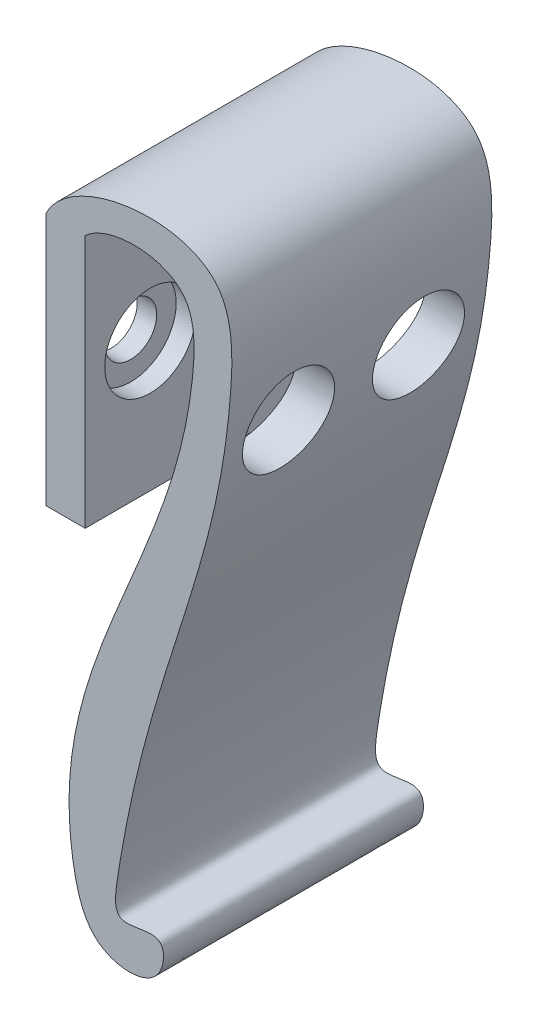
ISO-10303-21;
HEADER;
FILE_DESCRIPTION(('STEP AP214'),'2;1');
FILE_NAME('part.step','',(''),(''),'','','');
FILE_SCHEMA(('AUTOMOTIVE_DESIGN { 1 0 10303 214 1 1 1 1 }'));
ENDSEC;
DATA;
#1=APPLICATION_CONTEXT('core data for automotive mechanical design processes');
#2=APPLICATION_PROTOCOL_DEFINITION('international standard','automotive_design',2000,#1);
#3=PRODUCT_CONTEXT('',#1,'mechanical');
#4=PRODUCT('Part','Part','',(#3));
#5=PRODUCT_RELATED_PRODUCT_CATEGORY('part','',(#4));
#6=PRODUCT_DEFINITION_FORMATION('','',#4);
#7=PRODUCT_DEFINITION_CONTEXT('part definition',#1,'design');
#8=PRODUCT_DEFINITION('design','',#6,#7);
#9=PRODUCT_DEFINITION_SHAPE('','',#8);
#10=(LENGTH_UNIT() NAMED_UNIT(*) SI_UNIT(.MILLI.,.METRE.));
#11=(NAMED_UNIT(*) PLANE_ANGLE_UNIT() SI_UNIT($,.RADIAN.));
#12=(NAMED_UNIT(*) SI_UNIT($,.STERADIAN.) SOLID_ANGLE_UNIT());
#13=UNCERTAINTY_MEASURE_WITH_UNIT(LENGTH_MEASURE(1.E-05),#10,'distance_accuracy_value','');
#14=(GEOMETRIC_REPRESENTATION_CONTEXT(3) GLOBAL_UNCERTAINTY_ASSIGNED_CONTEXT((#13)) GLOBAL_UNIT_ASSIGNED_CONTEXT((#10,
#11,#12)) REPRESENTATION_CONTEXT('',''));
#15=CARTESIAN_POINT('',(0.,0.,0.));
#16=DIRECTION('',(0.,0.,1.));
#17=DIRECTION('',(1.,0.,0.));
#18=AXIS2_PLACEMENT_3D('',#15,#16,#17);
#19=CARTESIAN_POINT('',(17.,-9.49964059159015,15.));
#20=DIRECTION('',(-1.,0.,0.));
#21=DIRECTION('',(0.,-1.,0.));
#22=AXIS2_PLACEMENT_3D('',#19,#20,#21);
#23=CYLINDRICAL_SURFACE('',#22,2.);
#24=CARTESIAN_POINT('',(-3.,-9.49964059159015,15.));
#25=DIRECTION('',(-1.,0.,0.));
#26=DIRECTION('',(0.,-1.,0.));
#27=AXIS2_PLACEMENT_3D('',#24,#25,#26);
#28=CIRCLE('',#27,2.);
#29=CARTESIAN_POINT('',(-3.,-11.4996405915902,15.));
#30=VERTEX_POINT('',#29);
#31=EDGE_CURVE('E216',#30,#30,#28,.T.);
#32=ORIENTED_EDGE('',*,*,#31,.T.);
#33=EDGE_LOOP('',(#32));
#34=FACE_BOUND('',#33,.T.);
#35=CARTESIAN_POINT('',(-1.5,-9.49964059159015,15.));
#36=DIRECTION('',(1.,0.,0.));
#37=DIRECTION('',(0.,0.,-1.));
#38=AXIS2_PLACEMENT_3D('',#35,#36,#37);
#39=CIRCLE('',#38,2.);
#40=CARTESIAN_POINT('',(-1.5,-9.49964059159015,13.));
#41=VERTEX_POINT('',#40);
#42=EDGE_CURVE('E142',#41,#41,#39,.F.);
#43=ORIENTED_EDGE('',*,*,#42,.F.);
#44=EDGE_LOOP('',(#43));
#45=FACE_BOUND('',#44,.T.);
#46=ADVANCED_FACE('F43',(#34,#45),#23,.F.);
#47=CARTESIAN_POINT('',(17.,-9.49964059159015,5.));
#48=DIRECTION('',(-1.,0.,0.));
#49=DIRECTION('',(0.,-1.,0.));
#50=AXIS2_PLACEMENT_3D('',#47,#48,#49);
#51=CYLINDRICAL_SURFACE('',#50,2.);
#52=CARTESIAN_POINT('',(-3.,-9.49964059159015,5.));
#53=DIRECTION('',(-1.,0.,0.));
#54=DIRECTION('',(0.,-1.,0.));
#55=AXIS2_PLACEMENT_3D('',#52,#53,#54);
#56=CIRCLE('',#55,2.);
#57=CARTESIAN_POINT('',(-3.,-11.4996405915902,5.));
#58=VERTEX_POINT('',#57);
#59=EDGE_CURVE('E125',#58,#58,#56,.T.);
#60=ORIENTED_EDGE('',*,*,#59,.T.);
#61=EDGE_LOOP('',(#60));
#62=FACE_BOUND('',#61,.T.);
#63=CARTESIAN_POINT('',(-1.5,-9.49964059159015,5.));
#64=DIRECTION('',(1.,0.,0.));
#65=DIRECTION('',(0.,0.,-1.));
#66=AXIS2_PLACEMENT_3D('',#63,#64,#65);
#67=CIRCLE('',#66,2.);
#68=CARTESIAN_POINT('',(-1.5,-9.49964059159015,3.));
#69=VERTEX_POINT('',#68);
#70=EDGE_CURVE('E255',#69,#69,#67,.F.);
#71=ORIENTED_EDGE('',*,*,#70,.F.);
#72=EDGE_LOOP('',(#71));
#73=FACE_BOUND('',#72,.T.);
#74=ADVANCED_FACE('F186',(#62,#73),#51,.F.);
#75=CARTESIAN_POINT('',(0.,0.,20.));
#76=CARTESIAN_POINT('',(1.75597585765868,1.67272922806845,20.));
#77=CARTESIAN_POINT('',(8.49699578551517,1.75379068060112,20.));
#78=CARTESIAN_POINT('',(8.31601677325504,-17.9264470580925,20.));
#79=CARTESIAN_POINT('',(-4.63980321749147,-30.1593615317574,20.));
#80=CARTESIAN_POINT('',(0.417828729119297,-47.6626346677404,20.));
#81=CARTESIAN_POINT('',(5.96133388050679,-47.5435897462868,20.));
#82=CARTESIAN_POINT('',(6.23551003814559,-43.1137947879616,20.));
#83=CARTESIAN_POINT('',(1.97940404284951,-45.1414564134434,20.));
#84=CARTESIAN_POINT('',(4.61646194340332,-25.8164956673277,20.));
#85=CARTESIAN_POINT('',(11.0632473373829,-17.2125727301792,20.));
#86=CARTESIAN_POINT('',(11.5373296922346,5.7281691445607,20.));
#87=CARTESIAN_POINT('',(-1.16088851316124,3.82366739593619,20.));
#88=CARTESIAN_POINT('',(-3.00000000000001,0.,20.));
#89=B_SPLINE_CURVE_WITH_KNOTS('',3,(#75,#76,#77,#78,#79,#80,#81,#82,#83,#84,#85,#86,#87,#88),
.UNSPECIFIED.,.F.,.F.,(4,1,1,1,1,1,1,1,1,1,1,4),(0.,0.0625515425011504,0.100419616712041,
0.404902243384788,0.44515078429823,0.47842360950436,0.493843888432207,0.517517406710475,
0.537515348904661,0.834560093743225,0.886833812563257,1.),.UNSPECIFIED.);
#90=DIRECTION('',(0.,0.,-1.));
#91=VECTOR('',#90,1.);
#92=SURFACE_OF_LINEAR_EXTRUSION('',#89,#91);
#93=CARTESIAN_POINT('',(7.56702013978109,-9.49964059159015,1.5));
#94=CARTESIAN_POINT('',(7.61145619968119,-9.3025257874313,1.50000978114212));
#95=CARTESIAN_POINT('',(7.65436531492354,-9.10493174317928,1.51669993709107));
#96=CARTESIAN_POINT('',(7.73592145396016,-8.71441518056959,1.58346272929787));
#97=CARTESIAN_POINT('',(7.77456466744261,-8.52149695677518,1.63356493252474));
#98=CARTESIAN_POINT('',(7.84677100606195,-8.14598925153892,1.76622808703242));
#99=CARTESIAN_POINT('',(7.88033132547515,-7.96340550923333,1.84880687537714));
#100=CARTESIAN_POINT('',(7.94189544543416,-7.61433980171421,2.04438608013588));
#101=CARTESIAN_POINT('',(7.96990062506209,-7.44785384544468,2.15737892969843));
#102=CARTESIAN_POINT('',(8.01986470314724,-7.13875825632886,2.40862048169016));
#103=CARTESIAN_POINT('',(8.0419154734786,-6.99580094961403,2.54642321239327));
#104=CARTESIAN_POINT('',(8.08074940570241,-6.73493029199523,2.84463097390432));
#105=CARTESIAN_POINT('',(8.09753276817648,-6.61701598751503,3.00503514371776));
#106=CARTESIAN_POINT('',(8.12597260343528,-6.41127635572268,3.3415693118745));
#107=CARTESIAN_POINT('',(8.13769391948804,-6.32307386565653,3.51746338550033));
#108=CARTESIAN_POINT('',(8.1566788077871,-6.17729554950291,3.88173946137769));
#109=CARTESIAN_POINT('',(8.16394251950861,-6.11971876516678,4.07012107269882));
#110=CARTESIAN_POINT('',(8.17426731187572,-6.03711200102149,4.45310099545735));
#111=CARTESIAN_POINT('',(8.17734732641488,-6.01193541709532,4.64766719320594));
#112=CARTESIAN_POINT('',(8.17949954775935,-5.99439359479358,5.03829470392535));
#113=CARTESIAN_POINT('',(8.17857179113232,-6.00202805704377,5.23435600323828));
#114=CARTESIAN_POINT('',(8.17266985345827,-6.04986062803232,5.62222878857001));
#115=CARTESIAN_POINT('',(8.16769919120546,-6.09003041910706,5.81404382130935));
#116=CARTESIAN_POINT('',(8.1535110842963,-6.20170354895838,6.18815755642899));
#117=CARTESIAN_POINT('',(8.14429366962339,-6.27320666651129,6.37045632598709));
#118=CARTESIAN_POINT('',(8.12129126663065,-6.44544211374862,6.72044267324527));
#119=CARTESIAN_POINT('',(8.10750470126641,-6.5461845338975,6.88812518086246));
#120=CARTESIAN_POINT('',(8.07502192451991,-6.77386455993654,7.20410194813888));
#121=CARTESIAN_POINT('',(8.0563257441853,-6.90080200017226,7.3523963303968));
#122=CARTESIAN_POINT('',(8.01370183086139,-7.17744142032891,7.62589530579514));
#123=CARTESIAN_POINT('',(7.98976001464803,-7.32720434504586,7.75103603612598));
#124=CARTESIAN_POINT('',(7.93659657760728,-7.64476081296912,7.97440941675277));
#125=CARTESIAN_POINT('',(7.9073748022562,-7.81255488381806,8.07264127932002));
#126=CARTESIAN_POINT('',(7.84354604820934,-8.16290795433428,8.24056123152677));
#127=CARTESIAN_POINT('',(7.80889088152517,-8.34559127596236,8.30997139257278));
#128=CARTESIAN_POINT('',(7.73493288056415,-8.71906273574013,8.41737709773993));
#129=CARTESIAN_POINT('',(7.69562959596992,-8.90985165802464,8.45536959521122));
#130=CARTESIAN_POINT('',(7.61244988968217,-9.29801275359003,8.49974892131284));
#131=CARTESIAN_POINT('',(7.56849944458043,-9.49544081041641,8.50550725086709));
#132=CARTESIAN_POINT('',(7.47793953921064,-9.88786883398433,8.48395067844256));
#133=CARTESIAN_POINT('',(7.4313296947352,-10.0828684449017,8.45663098604548));
#134=CARTESIAN_POINT('',(7.33590811894617,-10.4697173629763,8.36885544020835));
#135=CARTESIAN_POINT('',(7.28707039881507,-10.6613906203552,8.30765075584047));
#136=CARTESIAN_POINT('',(7.19011623621306,-11.0316282299922,8.15329169723991));
#137=CARTESIAN_POINT('',(7.14199986843946,-11.2101912320205,8.06013403774752));
#138=CARTESIAN_POINT('',(7.04814030991878,-11.5507086466959,7.84327410152784));
#139=CARTESIAN_POINT('',(7.00242099885111,-11.7125075621352,7.71931683013531));
#140=CARTESIAN_POINT('',(6.91599245474935,-12.0128706732883,7.44440340388294));
#141=CARTESIAN_POINT('',(6.87528277663956,-12.1514369334807,7.29344965042544));
#142=CARTESIAN_POINT('',(6.80179857926973,-12.3981750499859,6.97197490234279));
#143=CARTESIAN_POINT('',(6.76887510060777,-12.506925162854,6.8019325314233));
#144=CARTESIAN_POINT('',(6.71171594027746,-12.6940079904619,6.44452905919824));
#145=CARTESIAN_POINT('',(6.68747778860645,-12.7723493536132,6.25717290082203));
#146=CARTESIAN_POINT('',(6.64994343797448,-12.8930507543901,5.87892869200147));
#147=CARTESIAN_POINT('',(6.63623005801631,-12.9367850517641,5.68852028928015));
#148=CARTESIAN_POINT('',(6.61890445974149,-12.9919699017271,5.3026372563254));
#149=CARTESIAN_POINT('',(6.61528997038655,-13.0034277126564,5.10716377510753));
#150=CARTESIAN_POINT('',(6.61831722361309,-12.9938081108118,4.72351814470229));
#151=CARTESIAN_POINT('',(6.62462925108747,-12.9737766420004,4.53531528192857));
#152=CARTESIAN_POINT('',(6.64655941961878,-12.9037970028935,4.16503368282922));
#153=CARTESIAN_POINT('',(6.66217736036767,-12.8538494765354,3.98295481477487));
#154=CARTESIAN_POINT('',(6.69192380957284,-12.7578740057461,3.71828785786334));
#155=CARTESIAN_POINT('',(6.70290749180293,-12.7223244700986,3.63138685010005));
#156=CARTESIAN_POINT('',(6.72684158404686,-12.6444846143304,3.46093565186579));
#157=CARTESIAN_POINT('',(6.73979159779113,-12.6021956523036,3.37738479052757));
#158=CARTESIAN_POINT('',(6.76749452189834,-12.5112182784997,3.21418731023849));
#159=CARTESIAN_POINT('',(6.78224698963286,-12.462531437628,3.13453973946141));
#160=CARTESIAN_POINT('',(6.81338660702169,-12.3590946440508,2.97954982618569));
#161=CARTESIAN_POINT('',(6.82977511299968,-12.3043396564621,2.90421113863367));
#162=CARTESIAN_POINT('',(6.88220222919252,-12.1278884991938,2.68072391946114));
#163=CARTESIAN_POINT('',(6.92061172524877,-11.9969009648437,2.54030126396489));
#164=CARTESIAN_POINT('',(7.00181575543592,-11.7145234200578,2.28324179531931));
#165=CARTESIAN_POINT('',(7.04461152156005,-11.5631276736826,2.16661169255988));
#166=CARTESIAN_POINT('',(7.11163188599536,-11.3205238679629,2.00930962473011));
#167=CARTESIAN_POINT('',(7.13494575985569,-11.2351739074728,1.95899305432911));
#168=CARTESIAN_POINT('',(7.18200802081803,-11.0606771749716,1.86584484875715));
#169=CARTESIAN_POINT('',(7.20575599966742,-10.9715338751821,1.82300654418769));
#170=CARTESIAN_POINT('',(7.25344834301984,-10.7900353663351,1.74506025625105));
#171=CARTESIAN_POINT('',(7.27739261171217,-10.6976816603831,1.70994871020777));
#172=CARTESIAN_POINT('',(7.32525518553453,-10.5103408516099,1.64765249549056));
#173=CARTESIAN_POINT('',(7.34917349022807,-10.4153537052065,1.62046795809065));
#174=CARTESIAN_POINT('',(7.40615210572919,-10.1854878826374,1.56509822781959));
#175=CARTESIAN_POINT('',(7.43910125672349,-10.0496378304346,1.54073906542863));
#176=CARTESIAN_POINT('',(7.50395721021981,-9.77581726320773,1.50818643703817));
#177=CARTESIAN_POINT('',(7.53586400169507,-9.6378467257744,1.4999931419974));
#178=CARTESIAN_POINT('',(7.56702013978109,-9.49964059159015,1.5));
#179=B_SPLINE_CURVE_WITH_KNOTS('',3,(#93,#94,#95,#96,#97,#98,#99,#100,#101,#102,#103,#104,#105,
#106,#107,#108,#109,#110,#111,#112,#113,#114,#115,#116,#117,#118,#119,#120,#121,#122,#123,#124,
#125,#126,#127,#128,#129,#130,#131,#132,#133,#134,#135,#136,#137,#138,#139,#140,#141,#142,#143,
#144,#145,#146,#147,#148,#149,#150,#151,#152,#153,#154,#155,#156,#157,#158,#159,#160,#161,#162,
#163,#164,#165,#166,#167,#168,#169,#170,#171,#172,#173,#174,#175,#176,#177,#178),.UNSPECIFIED.,
.T.,.F.,(4,2,2,2,2,2,2,2,2,2,2,2,2,2,2,2,2,2,2,2,2,2,2,2,2,2,2,2,2,2,2,2,2,2,2,2,2,2,2,2,2,2,4),
(0.,0.605703549852586,1.21194381103973,1.81851750265666,2.42494042133571,3.02138900583854,
3.61781487496563,4.20635612301943,4.79487895510429,5.38072937208422,5.96657444366475,
6.55191016249901,7.13724174873555,7.72277557319379,8.30830569491366,8.89542751377895,
9.48256651817967,10.0752427370363,10.6679764224592,11.2722279592937,11.8765670153845,
12.4948276964227,13.1131519632785,13.7367767482971,14.36034608795,14.9707930146328,
15.5810661995063,16.1656822054011,16.7501667322755,17.3156435336733,17.8811081637276,
18.1644392351722,18.4477132832559,18.7309179070563,19.0143592969669,19.5990740909401,
20.1839535690542,20.4890096800227,20.7937923249317,21.0984341439596,21.4030810076754,
21.8277627619458,22.2524490073246),.UNSPECIFIED.);
#180=CARTESIAN_POINT('',(7.56702013978109,-9.49964059159015,1.5));
#181=VERTEX_POINT('',#180);
#182=EDGE_CURVE('E218',#181,#181,#179,.T.);
#183=ORIENTED_EDGE('',*,*,#182,.T.);
#184=EDGE_LOOP('',(#183));
#185=FACE_BOUND('',#184,.T.);
#186=CARTESIAN_POINT('',(10.6439784913448,-9.49964059159015,1.5));
#187=CARTESIAN_POINT('',(10.6281576050431,-9.5994131409954,1.49999855895665));
#188=CARTESIAN_POINT('',(10.612072095706,-9.69912856270789,1.50426770647067));
#189=CARTESIAN_POINT('',(10.5794881785584,-9.89777620944997,1.52128994695874));
#190=CARTESIAN_POINT('',(10.5629897476225,-9.99670839020415,1.53404351612773));
#191=CARTESIAN_POINT('',(10.5297029272549,-10.1931618293352,1.56794968852816));
#192=CARTESIAN_POINT('',(10.5129143155337,-10.2906818904061,1.58910903085769));
#193=CARTESIAN_POINT('',(10.4791987992096,-10.4836055898432,1.63967596189153));
#194=CARTESIAN_POINT('',(10.4622717836512,-10.5790072425159,1.66909096376218));
#195=CARTESIAN_POINT('',(10.4115801518353,-10.8606772796865,1.76933508168761));
#196=CARTESIAN_POINT('',(10.3778374821601,-11.0428070444094,1.85223217056148));
#197=CARTESIAN_POINT('',(10.31184937608,-11.3904964066015,2.04797348337284));
#198=CARTESIAN_POINT('',(10.2796038888994,-11.5560565662346,2.1608166908414));
#199=CARTESIAN_POINT('',(10.2334761739155,-11.7882615293055,2.35005287181151));
#200=CARTESIAN_POINT('',(10.2184705052631,-11.8629892508712,2.41647767942125));
#201=CARTESIAN_POINT('',(10.1893836114593,-12.0065296743803,2.55552228427785));
#202=CARTESIAN_POINT('',(10.175301519056,-12.0753479447309,2.62813611818041));
#203=CARTESIAN_POINT('',(10.1482209114783,-12.2066269916998,2.77913629250224));
#204=CARTESIAN_POINT('',(10.135222782484,-12.2690855042847,2.85752467162637));
#205=CARTESIAN_POINT('',(10.1104818668572,-12.3871386298314,3.01949140206273));
#206=CARTESIAN_POINT('',(10.0987393509876,-12.4427317627276,3.10307086667298));
#207=CARTESIAN_POINT('',(10.0659769316023,-12.5969213159785,3.35810571212221));
#208=CARTESIAN_POINT('',(10.0469766668259,-12.6850665986723,3.53632477947015));
#209=CARTESIAN_POINT('',(10.0155149737039,-12.830023535657,3.90550523021636));
#210=CARTESIAN_POINT('',(10.0030526224296,-12.8868396126122,4.09646481080005));
#211=CARTESIAN_POINT('',(9.98553778510402,-12.9664659311052,4.4814350250095));
#212=CARTESIAN_POINT('',(9.98033276897391,-12.9899763454495,4.6752934585628));
#213=CARTESIAN_POINT('',(9.97713001392207,-13.0044582357937,5.06426664938119));
#214=CARTESIAN_POINT('',(9.97913164126235,-12.9954325729518,5.25938129467131));
#215=CARTESIAN_POINT('',(9.99016173795899,-12.9454544861937,5.64290086852004));
#216=CARTESIAN_POINT('',(9.99910651720489,-12.9048823022233,5.83135795021269));
#217=CARTESIAN_POINT('',(10.0234420200992,-12.7935699348328,6.19869308143744));
#218=CARTESIAN_POINT('',(10.0388328789848,-12.7228291184812,6.37757092991062));
#219=CARTESIAN_POINT('',(10.0753858269728,-12.5527965743418,6.72202601442553));
#220=CARTESIAN_POINT('',(10.0965853068481,-12.4533196354525,6.88750775584788));
#221=CARTESIAN_POINT('',(10.14365594392,-12.2289594022896,7.1994881319726));
#222=CARTESIAN_POINT('',(10.1695275612938,-12.1040736052444,7.34598489432649));
#223=CARTESIAN_POINT('',(10.2252818070254,-11.8297299681777,7.61894239611102));
#224=CARTESIAN_POINT('',(10.2552336137164,-11.6798351991856,7.74494982827746));
#225=CARTESIAN_POINT('',(10.3173920407893,-11.3614891647931,7.97010808277787));
#226=CARTESIAN_POINT('',(10.3495989045309,-11.1930358954811,8.06925600086678));
#227=CARTESIAN_POINT('',(10.4155463819348,-10.8388616954247,8.23972574746931));
#228=CARTESIAN_POINT('',(10.4493044042416,-10.6528771001639,8.31049351780581));
#229=CARTESIAN_POINT('',(10.5164662529898,-10.2715551690022,8.41957284862086));
#230=CARTESIAN_POINT('',(10.5498700632565,-10.0762174082294,8.45788293321354));
#231=CARTESIAN_POINT('',(10.6153741548297,-9.68041354305479,8.50102666021166));
#232=CARTESIAN_POINT('',(10.6474652478222,-9.47992343417454,8.50565479317613));
#233=CARTESIAN_POINT('',(10.7091703311124,-9.08071039377067,8.48058800951179));
#234=CARTESIAN_POINT('',(10.7387843960193,-8.88198740918179,8.45089412707549));
#235=CARTESIAN_POINT('',(10.7946424469149,-8.49341255524606,8.35814483412142));
#236=CARTESIAN_POINT('',(10.8209075574682,-8.30351043257879,8.29531285346866));
#237=CARTESIAN_POINT('',(10.8698509258003,-7.93678217331718,8.13803635446834));
#238=CARTESIAN_POINT('',(10.892529396178,-7.75995526201797,8.04359371088449));
#239=CARTESIAN_POINT('',(10.9338508907261,-7.42655450098346,7.82690703244758));
#240=CARTESIAN_POINT('',(10.9525360122899,-7.26977717541798,7.70498406041179));
#241=CARTESIAN_POINT('',(10.9861543168438,-6.97886374434877,7.43616533326675));
#242=CARTESIAN_POINT('',(11.0010876735981,-6.84472659035206,7.28927073525561));
#243=CARTESIAN_POINT('',(11.0271798766827,-6.60413526218877,6.97603675849786));
#244=CARTESIAN_POINT('',(11.0383696224631,-6.49745623140199,6.80987261962519));
#245=CARTESIAN_POINT('',(11.0572915543455,-6.3134549623629,6.46183593619836));
#246=CARTESIAN_POINT('',(11.0650238297372,-6.23613196599482,6.27996379745016));
#247=CARTESIAN_POINT('',(11.0771499300025,-6.11338725952546,5.90650975302963));
#248=CARTESIAN_POINT('',(11.0815577838809,-6.06783155411221,5.71497233102975));
#249=CARTESIAN_POINT('',(11.0871893928057,-6.00942375261942,5.32692870352019));
#250=CARTESIAN_POINT('',(11.0884131756963,-5.99657137055598,5.13042254147631));
#251=CARTESIAN_POINT('',(11.0877075765988,-6.00394036503592,4.73832845487987));
#252=CARTESIAN_POINT('',(11.0857828427867,-6.02411298658486,4.54273960345932));
#253=CARTESIAN_POINT('',(11.0787418621911,-6.09685087838111,4.15774091998215));
#254=CARTESIAN_POINT('',(11.0736256221642,-6.14941608005204,3.96833107484522));
#255=CARTESIAN_POINT('',(11.060089163939,-6.28540715362356,3.60105340038574));
#256=CARTESIAN_POINT('',(11.0516688202134,-6.36883419800051,3.42318600987592));
#257=CARTESIAN_POINT('',(11.0313782565987,-6.56410744888682,3.08403220041964));
#258=CARTESIAN_POINT('',(11.0195081709758,-6.67595254932731,2.92274513648772));
#259=CARTESIAN_POINT('',(10.9921646366427,-6.92497504667784,2.62104810989948));
#260=CARTESIAN_POINT('',(10.9766860650142,-7.06218840069412,2.48066829773123));
#261=CARTESIAN_POINT('',(10.9420633275855,-7.35788005594881,2.2249185331641));
#262=CARTESIAN_POINT('',(10.9229182366882,-7.51636372085997,2.1095549082806));
#263=CARTESIAN_POINT('',(10.8809283158445,-7.85075516457473,1.90651677597069));
#264=CARTESIAN_POINT('',(10.8580662408792,-8.02674259914483,1.81897723957879));
#265=CARTESIAN_POINT('',(10.8089598025474,-8.39031725395875,1.6747078938286));
#266=CARTESIAN_POINT('',(10.7827192470336,-8.57789129308239,1.61794376753099));
#267=CARTESIAN_POINT('',(10.7375738219623,-8.88875610890428,1.55152464418591));
#268=CARTESIAN_POINT('',(10.7195387234387,-9.0102043401227,1.53221384092158));
#269=CARTESIAN_POINT('',(10.6824617796635,-9.25434400021804,1.5064524039944));
#270=CARTESIAN_POINT('',(10.6634199343735,-9.3770354291423,1.50000177082129));
#271=CARTESIAN_POINT('',(10.6439784913448,-9.49964059159015,1.5));
#272=B_SPLINE_CURVE_WITH_KNOTS('',3,(#186,#187,#188,#189,#190,#191,#192,#193,#194,#195,#196,
#197,#198,#199,#200,#201,#202,#203,#204,#205,#206,#207,#208,#209,#210,#211,#212,#213,#214,#215,
#216,#217,#218,#219,#220,#221,#222,#223,#224,#225,#226,#227,#228,#229,#230,#231,#232,#233,#234,
#235,#236,#237,#238,#239,#240,#241,#242,#243,#244,#245,#246,#247,#248,#249,#250,#251,#252,#253,
#254,#255,#256,#257,#258,#259,#260,#261,#262,#263,#264,#265,#266,#267,#268,#269,#270,#271),
.UNSPECIFIED.,.T.,.F.,(4,2,2,2,2,2,2,2,2,2,2,2,2,2,2,2,2,2,2,2,2,2,2,2,2,2,2,2,2,2,2,2,2,2,2,2,
2,2,2,2,2,2,4),(0.,0.302940839531871,0.605898683294753,0.909099906970741,1.21257426596232,
1.81831495798869,2.42403509182981,2.72703411398005,3.02974441681087,3.33256210857936,
3.63544496943096,4.2314538447456,4.8273785614487,5.41057941237731,5.99372897902869,
6.56995660379526,7.14619631829006,7.72623622194162,8.30633328718817,8.8978974431145,
9.48952553773191,10.0921990512287,10.6948999674676,11.3012751864235,11.9076321345301,
12.5099520925787,13.1122363345914,13.7078184808725,14.3033730374713,14.8938831321058,
15.4843779758566,16.0723667791646,16.6603504406128,17.247466841067,17.8345819985768,
18.4217194635478,19.0088340798406,19.596787346014,20.1848891542098,20.7758017046086,
21.3660539799266,21.7383217995811,22.1105896334121),.UNSPECIFIED.);
#273=CARTESIAN_POINT('',(10.6439784913448,-9.49964059159015,1.5));
#274=VERTEX_POINT('',#273);
#275=EDGE_CURVE('E224',#274,#274,#272,.T.);
#276=ORIENTED_EDGE('',*,*,#275,.T.);
#277=EDGE_LOOP('',(#276));
#278=FACE_BOUND('',#277,.T.);
#279=CARTESIAN_POINT('',(7.56702013978109,-9.49964059159015,11.5));
#280=CARTESIAN_POINT('',(7.61145619968119,-9.3025257874313,11.5000097811421));
#281=CARTESIAN_POINT('',(7.65436531492354,-9.10493174317928,11.5166999370911));
#282=CARTESIAN_POINT('',(7.73592145396016,-8.71441518056959,11.5834627292979));
#283=CARTESIAN_POINT('',(7.77456466744261,-8.52149695677518,11.6335649325247));
#284=CARTESIAN_POINT('',(7.84677100606195,-8.14598925153892,11.7662280870324));
#285=CARTESIAN_POINT('',(7.88033132547515,-7.96340550923333,11.8488068753771));
#286=CARTESIAN_POINT('',(7.94189544543416,-7.61433980171421,12.0443860801359));
#287=CARTESIAN_POINT('',(7.96990062506209,-7.44785384544468,12.1573789296984));
#288=CARTESIAN_POINT('',(8.01986470314724,-7.13875825632886,12.4086204816902));
#289=CARTESIAN_POINT('',(8.0419154734786,-6.99580094961403,12.5464232123933));
#290=CARTESIAN_POINT('',(8.08074940570241,-6.73493029199523,12.8446309739043));
#291=CARTESIAN_POINT('',(8.09753276817648,-6.61701598751503,13.0050351437178));
#292=CARTESIAN_POINT('',(8.12597260343528,-6.41127635572268,13.3415693118745));
#293=CARTESIAN_POINT('',(8.13769391948804,-6.32307386565653,13.5174633855003));
#294=CARTESIAN_POINT('',(8.1566788077871,-6.17729554950291,13.8817394613777));
#295=CARTESIAN_POINT('',(8.16394251950861,-6.11971876516678,14.0701210726988));
#296=CARTESIAN_POINT('',(8.17426731187572,-6.03711200102149,14.4531009954573));
#297=CARTESIAN_POINT('',(8.17734732641488,-6.01193541709532,14.6476671932059));
#298=CARTESIAN_POINT('',(8.17949954775935,-5.99439359479358,15.0382947039253));
#299=CARTESIAN_POINT('',(8.17857179113232,-6.00202805704377,15.2343560032383));
#300=CARTESIAN_POINT('',(8.17266985345827,-6.04986062803232,15.62222878857));
#301=CARTESIAN_POINT('',(8.16769919120546,-6.09003041910706,15.8140438213094));
#302=CARTESIAN_POINT('',(8.1535110842963,-6.20170354895838,16.188157556429));
#303=CARTESIAN_POINT('',(8.14429366962339,-6.27320666651129,16.3704563259871));
#304=CARTESIAN_POINT('',(8.12129126663065,-6.44544211374862,16.7204426732453));
#305=CARTESIAN_POINT('',(8.10750470126641,-6.54618453389749,16.8881251808625));
#306=CARTESIAN_POINT('',(8.07502192451991,-6.77386455993654,17.2041019481389));
#307=CARTESIAN_POINT('',(8.0563257441853,-6.90080200017226,17.3523963303968));
#308=CARTESIAN_POINT('',(8.01370183086139,-7.17744142032891,17.6258953057951));
#309=CARTESIAN_POINT('',(7.98976001464803,-7.32720434504586,17.751036036126));
#310=CARTESIAN_POINT('',(7.93659657760728,-7.64476081296912,17.9744094167528));
#311=CARTESIAN_POINT('',(7.9073748022562,-7.81255488381806,18.07264127932));
#312=CARTESIAN_POINT('',(7.84354604820934,-8.16290795433428,18.2405612315268));
#313=CARTESIAN_POINT('',(7.80889088152517,-8.34559127596236,18.3099713925728));
#314=CARTESIAN_POINT('',(7.73493288056415,-8.71906273574013,18.4173770977399));
#315=CARTESIAN_POINT('',(7.69562959596992,-8.90985165802464,18.4553695952112));
#316=CARTESIAN_POINT('',(7.61244988968217,-9.29801275359003,18.4997489213128));
#317=CARTESIAN_POINT('',(7.56849944458043,-9.49544081041641,18.5055072508671));
#318=CARTESIAN_POINT('',(7.47793953921064,-9.88786883398433,18.4839506784426));
#319=CARTESIAN_POINT('',(7.4313296947352,-10.0828684449017,18.4566309860455));
#320=CARTESIAN_POINT('',(7.33590811894617,-10.4697173629763,18.3688554402083));
#321=CARTESIAN_POINT('',(7.28707039881506,-10.6613906203552,18.3076507558405));
#322=CARTESIAN_POINT('',(7.19011623621306,-11.0316282299922,18.1532916972399));
#323=CARTESIAN_POINT('',(7.14199986843946,-11.2101912320205,18.0601340377475));
#324=CARTESIAN_POINT('',(7.04814030991878,-11.5507086466959,17.8432741015278));
#325=CARTESIAN_POINT('',(7.00242099885111,-11.7125075621351,17.7193168301353));
#326=CARTESIAN_POINT('',(6.91599245474935,-12.0128706732883,17.4444034038829));
#327=CARTESIAN_POINT('',(6.87528277663956,-12.1514369334807,17.2934496504254));
#328=CARTESIAN_POINT('',(6.80179857926973,-12.3981750499859,16.9719749023428));
#329=CARTESIAN_POINT('',(6.76887510060777,-12.506925162854,16.8019325314233));
#330=CARTESIAN_POINT('',(6.71171594027746,-12.6940079904619,16.4445290591982));
#331=CARTESIAN_POINT('',(6.68747778860645,-12.7723493536132,16.257172900822));
#332=CARTESIAN_POINT('',(6.64994343797448,-12.8930507543901,15.8789286920015));
#333=CARTESIAN_POINT('',(6.63623005801631,-12.9367850517641,15.6885202892801));
#334=CARTESIAN_POINT('',(6.61890445974149,-12.9919699017271,15.3026372563254));
#335=CARTESIAN_POINT('',(6.61528997038655,-13.0034277126564,15.1071637751075));
#336=CARTESIAN_POINT('',(6.61831722361309,-12.9938081108118,14.7235181447023));
#337=CARTESIAN_POINT('',(6.62462925108747,-12.9737766420004,14.5353152819286));
#338=CARTESIAN_POINT('',(6.64655941961878,-12.9037970028935,14.1650336828292));
#339=CARTESIAN_POINT('',(6.66217736036767,-12.8538494765354,13.9829548147749));
#340=CARTESIAN_POINT('',(6.69192380957284,-12.7578740057461,13.7182878578633));
#341=CARTESIAN_POINT('',(6.70290749180293,-12.7223244700986,13.6313868501));
#342=CARTESIAN_POINT('',(6.72684158404686,-12.6444846143304,13.4609356518658));
#343=CARTESIAN_POINT('',(6.73979159779113,-12.6021956523036,13.3773847905276));
#344=CARTESIAN_POINT('',(6.76749452189834,-12.5112182784997,13.2141873102385));
#345=CARTESIAN_POINT('',(6.78224698963286,-12.462531437628,13.1345397394614));
#346=CARTESIAN_POINT('',(6.81338660702169,-12.3590946440508,12.9795498261857));
#347=CARTESIAN_POINT('',(6.82977511299968,-12.3043396564621,12.9042111386337));
#348=CARTESIAN_POINT('',(6.88220222919252,-12.1278884991938,12.6807239194611));
#349=CARTESIAN_POINT('',(6.92061172524877,-11.9969009648437,12.5403012639649));
#350=CARTESIAN_POINT('',(7.00181575543592,-11.7145234200578,12.2832417953193));
#351=CARTESIAN_POINT('',(7.04461152156005,-11.5631276736826,12.1666116925599));
#352=CARTESIAN_POINT('',(7.11163188599536,-11.3205238679629,12.0093096247301));
#353=CARTESIAN_POINT('',(7.13494575985569,-11.2351739074728,11.9589930543291));
#354=CARTESIAN_POINT('',(7.18200802081803,-11.0606771749716,11.8658448487572));
#355=CARTESIAN_POINT('',(7.20575599966742,-10.9715338751821,11.8230065441877));
#356=CARTESIAN_POINT('',(7.25344834301984,-10.7900353663351,11.745060256251));
#357=CARTESIAN_POINT('',(7.27739261171217,-10.6976816603831,11.7099487102078));
#358=CARTESIAN_POINT('',(7.32525518553453,-10.5103408516099,11.6476524954906));
#359=CARTESIAN_POINT('',(7.34917349022807,-10.4153537052065,11.6204679580906));
#360=CARTESIAN_POINT('',(7.40615210572919,-10.1854878826374,11.5650982278196));
#361=CARTESIAN_POINT('',(7.43910125672349,-10.0496378304346,11.5407390654286));
#362=CARTESIAN_POINT('',(7.50395721021981,-9.77581726320773,11.5081864370382));
#363=CARTESIAN_POINT('',(7.53586400169507,-9.6378467257744,11.4999931419974));
#364=CARTESIAN_POINT('',(7.56702013978109,-9.49964059159015,11.5));
#365=B_SPLINE_CURVE_WITH_KNOTS('',3,(#279,#280,#281,#282,#283,#284,#285,#286,#287,#288,#289,
#290,#291,#292,#293,#294,#295,#296,#297,#298,#299,#300,#301,#302,#303,#304,#305,#306,#307,#308,
#309,#310,#311,#312,#313,#314,#315,#316,#317,#318,#319,#320,#321,#322,#323,#324,#325,#326,#327,
#328,#329,#330,#331,#332,#333,#334,#335,#336,#337,#338,#339,#340,#341,#342,#343,#344,#345,#346,
#347,#348,#349,#350,#351,#352,#353,#354,#355,#356,#357,#358,#359,#360,#361,#362,#363,#364),
.UNSPECIFIED.,.T.,.F.,(4,2,2,2,2,2,2,2,2,2,2,2,2,2,2,2,2,2,2,2,2,2,2,2,2,2,2,2,2,2,2,2,2,2,2,2,
2,2,2,2,2,2,4),(0.,0.605703549852586,1.21194381103973,1.81851750265666,2.42494042133571,
3.02138900583854,3.61781487496564,4.20635612301943,4.79487895510429,5.38072937208422,
5.96657444366475,6.55191016249901,7.13724174873555,7.72277557319378,8.30830569491366,
8.89542751377894,9.48256651817967,10.0752427370363,10.6679764224592,11.2722279592937,
11.8765670153845,12.4948276964227,13.1131519632785,13.7367767482971,14.36034608795,
14.9707930146328,15.5810661995063,16.1656822054011,16.7501667322755,17.3156435336733,
17.8811081637276,18.1644392351722,18.4477132832559,18.7309179070563,19.0143592969669,
19.5990740909401,20.1839535690542,20.4890096800227,20.7937923249317,21.0984341439596,
21.4030810076754,21.8277627619458,22.2524490073246),.UNSPECIFIED.);
#366=CARTESIAN_POINT('',(7.56702013978109,-9.49964059159015,11.5));
#367=VERTEX_POINT('',#366);
#368=EDGE_CURVE('E154',#367,#367,#365,.T.);
#369=ORIENTED_EDGE('',*,*,#368,.T.);
#370=EDGE_LOOP('',(#369));
#371=FACE_BOUND('',#370,.T.);
#372=CARTESIAN_POINT('',(10.6439784913448,-9.49964059159015,11.5));
#373=CARTESIAN_POINT('',(10.6281576050431,-9.5994131409954,11.4999985589567));
#374=CARTESIAN_POINT('',(10.612072095706,-9.69912856270789,11.5042677064707));
#375=CARTESIAN_POINT('',(10.5794881785584,-9.89777620944997,11.5212899469587));
#376=CARTESIAN_POINT('',(10.5629897476225,-9.99670839020415,11.5340435161277));
#377=CARTESIAN_POINT('',(10.5297029272549,-10.1931618293352,11.5679496885282));
#378=CARTESIAN_POINT('',(10.5129143155337,-10.2906818904061,11.5891090308577));
#379=CARTESIAN_POINT('',(10.4791987992096,-10.4836055898432,11.6396759618915));
#380=CARTESIAN_POINT('',(10.4622717836512,-10.5790072425159,11.6690909637622));
#381=CARTESIAN_POINT('',(10.4115801518353,-10.8606772796865,11.7693350816876));
#382=CARTESIAN_POINT('',(10.3778374821601,-11.0428070444094,11.8522321705615));
#383=CARTESIAN_POINT('',(10.31184937608,-11.3904964066015,12.0479734833728));
#384=CARTESIAN_POINT('',(10.2796038888994,-11.5560565662346,12.1608166908414));
#385=CARTESIAN_POINT('',(10.2334761739155,-11.7882615293055,12.3500528718115));
#386=CARTESIAN_POINT('',(10.2184705052631,-11.8629892508712,12.4164776794212));
#387=CARTESIAN_POINT('',(10.1893836114593,-12.0065296743803,12.5555222842778));
#388=CARTESIAN_POINT('',(10.175301519056,-12.0753479447309,12.6281361181804));
#389=CARTESIAN_POINT('',(10.1482209114783,-12.2066269916998,12.7791362925022));
#390=CARTESIAN_POINT('',(10.135222782484,-12.2690855042847,12.8575246716264));
#391=CARTESIAN_POINT('',(10.1104818668572,-12.3871386298314,13.0194914020627));
#392=CARTESIAN_POINT('',(10.0987393509876,-12.4427317627276,13.103070866673));
#393=CARTESIAN_POINT('',(10.0659769316023,-12.5969213159785,13.3581057121222));
#394=CARTESIAN_POINT('',(10.0469766668259,-12.6850665986723,13.5363247794701));
#395=CARTESIAN_POINT('',(10.0155149737039,-12.830023535657,13.9055052302164));
#396=CARTESIAN_POINT('',(10.0030526224296,-12.8868396126122,14.0964648108001));
#397=CARTESIAN_POINT('',(9.98553778510402,-12.9664659311052,14.4814350250095));
#398=CARTESIAN_POINT('',(9.98033276897391,-12.9899763454495,14.6752934585628));
#399=CARTESIAN_POINT('',(9.97713001392207,-13.0044582357937,15.0642666493812));
#400=CARTESIAN_POINT('',(9.97913164126235,-12.9954325729518,15.2593812946713));
#401=CARTESIAN_POINT('',(9.99016173795899,-12.9454544861937,15.64290086852));
#402=CARTESIAN_POINT('',(9.99910651720489,-12.9048823022233,15.8313579502127));
#403=CARTESIAN_POINT('',(10.0234420200992,-12.7935699348328,16.1986930814374));
#404=CARTESIAN_POINT('',(10.0388328789848,-12.7228291184812,16.3775709299106));
#405=CARTESIAN_POINT('',(10.0753858269728,-12.5527965743418,16.7220260144255));
#406=CARTESIAN_POINT('',(10.0965853068481,-12.4533196354525,16.8875077558479));
#407=CARTESIAN_POINT('',(10.14365594392,-12.2289594022896,17.1994881319726));
#408=CARTESIAN_POINT('',(10.1695275612938,-12.1040736052444,17.3459848943265));
#409=CARTESIAN_POINT('',(10.2252818070254,-11.8297299681777,17.618942396111));
#410=CARTESIAN_POINT('',(10.2552336137164,-11.6798351991856,17.7449498282775));
#411=CARTESIAN_POINT('',(10.3173920407893,-11.3614891647931,17.9701080827779));
#412=CARTESIAN_POINT('',(10.3495989045309,-11.1930358954811,18.0692560008668));
#413=CARTESIAN_POINT('',(10.4155463819348,-10.8388616954247,18.2397257474693));
#414=CARTESIAN_POINT('',(10.4493044042416,-10.6528771001639,18.3104935178058));
#415=CARTESIAN_POINT('',(10.5164662529898,-10.2715551690022,18.4195728486209));
#416=CARTESIAN_POINT('',(10.5498700632565,-10.0762174082294,18.4578829332135));
#417=CARTESIAN_POINT('',(10.6153741548297,-9.68041354305479,18.5010266602117));
#418=CARTESIAN_POINT('',(10.6474652478221,-9.47992343417454,18.5056547931761));
#419=CARTESIAN_POINT('',(10.7091703311124,-9.08071039377067,18.4805880095118));
#420=CARTESIAN_POINT('',(10.7387843960193,-8.88198740918179,18.4508941270755));
#421=CARTESIAN_POINT('',(10.7946424469149,-8.49341255524606,18.3581448341214));
#422=CARTESIAN_POINT('',(10.8209075574682,-8.30351043257879,18.2953128534687));
#423=CARTESIAN_POINT('',(10.8698509258003,-7.93678217331718,18.1380363544683));
#424=CARTESIAN_POINT('',(10.892529396178,-7.75995526201797,18.0435937108845));
#425=CARTESIAN_POINT('',(10.9338508907261,-7.42655450098346,17.8269070324476));
#426=CARTESIAN_POINT('',(10.9525360122899,-7.26977717541798,17.7049840604118));
#427=CARTESIAN_POINT('',(10.9861543168438,-6.97886374434877,17.4361653332667));
#428=CARTESIAN_POINT('',(11.0010876735981,-6.84472659035206,17.2892707352556));
#429=CARTESIAN_POINT('',(11.0271798766827,-6.60413526218877,16.9760367584979));
#430=CARTESIAN_POINT('',(11.0383696224631,-6.49745623140199,16.8098726196252));
#431=CARTESIAN_POINT('',(11.0572915543455,-6.3134549623629,16.4618359361984));
#432=CARTESIAN_POINT('',(11.0650238297372,-6.23613196599482,16.2799637974502));
#433=CARTESIAN_POINT('',(11.0771499300025,-6.11338725952546,15.9065097530296));
#434=CARTESIAN_POINT('',(11.0815577838809,-6.06783155411222,15.7149723310297));
#435=CARTESIAN_POINT('',(11.0871893928057,-6.00942375261942,15.3269287035202));
#436=CARTESIAN_POINT('',(11.0884131756963,-5.99657137055598,15.1304225414763));
#437=CARTESIAN_POINT('',(11.0877075765988,-6.00394036503592,14.7383284548799));
#438=CARTESIAN_POINT('',(11.0857828427867,-6.02411298658486,14.5427396034593));
#439=CARTESIAN_POINT('',(11.0787418621911,-6.09685087838111,14.1577409199821));
#440=CARTESIAN_POINT('',(11.0736256221642,-6.14941608005204,13.9683310748452));
#441=CARTESIAN_POINT('',(11.060089163939,-6.28540715362356,13.6010534003857));
#442=CARTESIAN_POINT('',(11.0516688202134,-6.36883419800051,13.4231860098759));
#443=CARTESIAN_POINT('',(11.0313782565987,-6.56410744888682,13.0840322004196));
#444=CARTESIAN_POINT('',(11.0195081709758,-6.67595254932731,12.9227451364877));
#445=CARTESIAN_POINT('',(10.9921646366427,-6.92497504667784,12.6210481098995));
#446=CARTESIAN_POINT('',(10.9766860650142,-7.06218840069412,12.4806682977312));
#447=CARTESIAN_POINT('',(10.9420633275855,-7.35788005594881,12.2249185331641));
#448=CARTESIAN_POINT('',(10.9229182366882,-7.51636372085997,12.1095549082806));
#449=CARTESIAN_POINT('',(10.8809283158445,-7.85075516457473,11.9065167759707));
#450=CARTESIAN_POINT('',(10.8580662408792,-8.02674259914483,11.8189772395788));
#451=CARTESIAN_POINT('',(10.8089598025474,-8.39031725395874,11.6747078938286));
#452=CARTESIAN_POINT('',(10.7827192470336,-8.57789129308238,11.617943767531));
#453=CARTESIAN_POINT('',(10.7375738219623,-8.88875610890427,11.5515246441859));
#454=CARTESIAN_POINT('',(10.7195387234387,-9.01020434012269,11.5322138409216));
#455=CARTESIAN_POINT('',(10.6824617796635,-9.25434400021803,11.5064524039944));
#456=CARTESIAN_POINT('',(10.6634199343735,-9.3770354291423,11.5000017708213));
#457=CARTESIAN_POINT('',(10.6439784913448,-9.49964059159015,11.5));
#458=B_SPLINE_CURVE_WITH_KNOTS('',3,(#372,#373,#374,#375,#376,#377,#378,#379,#380,#381,#382,
#383,#384,#385,#386,#387,#388,#389,#390,#391,#392,#393,#394,#395,#396,#397,#398,#399,#400,#401,
#402,#403,#404,#405,#406,#407,#408,#409,#410,#411,#412,#413,#414,#415,#416,#417,#418,#419,#420,
#421,#422,#423,#424,#425,#426,#427,#428,#429,#430,#431,#432,#433,#434,#435,#436,#437,#438,#439,
#440,#441,#442,#443,#444,#445,#446,#447,#448,#449,#450,#451,#452,#453,#454,#455,#456,#457),
.UNSPECIFIED.,.T.,.F.,(4,2,2,2,2,2,2,2,2,2,2,2,2,2,2,2,2,2,2,2,2,2,2,2,2,2,2,2,2,2,2,2,2,2,2,2,
2,2,2,2,2,2,4),(0.,0.302940839531871,0.605898683294753,0.909099906970742,1.21257426596232,
1.81831495798869,2.42403509182981,2.72703411398005,3.02974441681087,3.33256210857936,
3.63544496943096,4.2314538447456,4.8273785614487,5.41057941237731,5.99372897902869,
6.56995660379525,7.14619631829005,7.72623622194162,8.30633328718817,8.8978974431145,
9.48952553773191,10.0921990512287,10.6948999674676,11.3012751864235,11.9076321345301,
12.5099520925787,13.1122363345914,13.7078184808725,14.3033730374713,14.8938831321058,
15.4843779758565,16.0723667791646,16.6603504406128,17.247466841067,17.8345819985768,
18.4217194635478,19.0088340798406,19.596787346014,20.1848891542098,20.7758017046086,
21.3660539799266,21.7383217995811,22.1105896334121),.UNSPECIFIED.);
#459=CARTESIAN_POINT('',(10.6439784913448,-9.49964059159015,11.5));
#460=VERTEX_POINT('',#459);
#461=EDGE_CURVE('E149',#460,#460,#458,.T.);
#462=ORIENTED_EDGE('',*,*,#461,.T.);
#463=EDGE_LOOP('',(#462));
#464=FACE_BOUND('',#463,.T.);
#465=CARTESIAN_POINT('',(0.,0.,0.));
#466=CARTESIAN_POINT('',(1.75597585765868,1.67272922806845,0.));
#467=CARTESIAN_POINT('',(8.49699578551517,1.75379068060112,0.));
#468=CARTESIAN_POINT('',(8.31601677325504,-17.9264470580925,0.));
#469=CARTESIAN_POINT('',(-4.63980321749147,-30.1593615317574,0.));
#470=CARTESIAN_POINT('',(0.417828729119297,-47.6626346677404,0.));
#471=CARTESIAN_POINT('',(5.96133388050679,-47.5435897462868,0.));
#472=CARTESIAN_POINT('',(6.23551003814559,-43.1137947879616,0.));
#473=CARTESIAN_POINT('',(1.97940404284951,-45.1414564134434,0.));
#474=CARTESIAN_POINT('',(4.61646194340332,-25.8164956673277,0.));
#475=CARTESIAN_POINT('',(11.0632473373829,-17.2125727301792,0.));
#476=CARTESIAN_POINT('',(11.5373296922346,5.7281691445607,0.));
#477=CARTESIAN_POINT('',(-1.16088851316124,3.82366739593619,0.));
#478=CARTESIAN_POINT('',(-3.00000000000001,0.,0.));
#479=B_SPLINE_CURVE_WITH_KNOTS('',3,(#465,#466,#467,#468,#469,#470,#471,#472,#473,#474,#475,
#476,#477,#478),.UNSPECIFIED.,.F.,.F.,(4,1,1,1,1,1,1,1,1,1,1,4),(0.,0.0625515425011504,
0.100419616712041,0.404902243384788,0.44515078429823,0.47842360950436,0.493843888432207,
0.517517406710475,0.537515348904661,0.834560093743225,0.886833812563257,1.),.UNSPECIFIED.);
#480=CARTESIAN_POINT('',(0.,0.,0.));
#481=VERTEX_POINT('',#480);
#482=CARTESIAN_POINT('',(-3.,0.,0.));
#483=VERTEX_POINT('',#482);
#484=EDGE_CURVE('E120',#481,#483,#479,.T.);
#485=ORIENTED_EDGE('',*,*,#484,.T.);
#486=DIRECTION('',(0.,0.,-1.));
#487=VECTOR('',#486,1.);
#488=CARTESIAN_POINT('',(-3.,0.,20.));
#489=LINE('',#488,#487);
#490=CARTESIAN_POINT('',(-3.,0.,20.));
#491=VERTEX_POINT('',#490);
#492=EDGE_CURVE('E11',#491,#483,#489,.T.);
#493=ORIENTED_EDGE('',*,*,#492,.F.);
#494=CARTESIAN_POINT('',(0.,0.,20.));
#495=VERTEX_POINT('',#494);
#496=EDGE_CURVE('E102',#495,#491,#89,.T.);
#497=ORIENTED_EDGE('',*,*,#496,.F.);
#498=DIRECTION('',(0.,0.,-1.));
#499=VECTOR('',#498,1.);
#500=CARTESIAN_POINT('',(0.,0.,20.));
#501=LINE('',#500,#499);
#502=EDGE_CURVE('E67',#495,#481,#501,.T.);
#503=ORIENTED_EDGE('',*,*,#502,.T.);
#504=EDGE_LOOP('',(#485,#493,#497,#503));
#505=FACE_BOUND('',#504,.T.);
#506=ADVANCED_FACE('F45',(#185,#278,#371,#464,#505),#92,.F.);
#507=CARTESIAN_POINT('',(-3.,0.,20.));
#508=DIRECTION('',(1.,0.,0.));
#509=DIRECTION('',(0.,1.,0.));
#510=AXIS2_PLACEMENT_3D('',#507,#508,#509);
#511=PLANE('',#510);
#512=ORIENTED_EDGE('',*,*,#59,.F.);
#513=EDGE_LOOP('',(#512));
#514=FACE_BOUND('',#513,.T.);
#515=ORIENTED_EDGE('',*,*,#31,.F.);
#516=EDGE_LOOP('',(#515));
#517=FACE_BOUND('',#516,.T.);
#518=DIRECTION('',(0.,-1.,0.));
#519=VECTOR('',#518,1.);
#520=CARTESIAN_POINT('',(-3.,0.,0.));
#521=LINE('',#520,#519);
#522=CARTESIAN_POINT('',(-3.,-19.4996405915902,0.));
#523=VERTEX_POINT('',#522);
#524=EDGE_CURVE('E108',#483,#523,#521,.T.);
#525=ORIENTED_EDGE('',*,*,#524,.T.);
#526=DIRECTION('',(0.,0.,-1.));
#527=VECTOR('',#526,1.);
#528=CARTESIAN_POINT('',(-3.,-19.4996405915902,20.));
#529=LINE('',#528,#527);
#530=CARTESIAN_POINT('',(-3.,-19.4996405915902,20.));
#531=VERTEX_POINT('',#530);
#532=EDGE_CURVE('E56',#531,#523,#529,.T.);
#533=ORIENTED_EDGE('',*,*,#532,.F.);
#534=DIRECTION('',(0.,-1.,0.));
#535=VECTOR('',#534,1.);
#536=CARTESIAN_POINT('',(-3.,0.,20.));
#537=LINE('',#536,#535);
#538=EDGE_CURVE('E94',#491,#531,#537,.T.);
#539=ORIENTED_EDGE('',*,*,#538,.F.);
#540=ORIENTED_EDGE('',*,*,#492,.T.);
#541=EDGE_LOOP('',(#525,#533,#539,#540));
#542=FACE_BOUND('',#541,.T.);
#543=ADVANCED_FACE('F107',(#514,#517,#542),#511,.F.);
#544=CARTESIAN_POINT('',(0.,-19.4996405915902,20.));
#545=DIRECTION('',(0.,-1.,0.));
#546=DIRECTION('',(0.,0.,-1.));
#547=AXIS2_PLACEMENT_3D('',#544,#545,#546);
#548=PLANE('',#547);
#549=DIRECTION('',(-1.,0.,0.));
#550=VECTOR('',#549,1.);
#551=CARTESIAN_POINT('',(0.,-19.4996405915902,0.));
#552=LINE('',#551,#550);
#553=CARTESIAN_POINT('',(0.,-19.4996405915902,0.));
#554=VERTEX_POINT('',#553);
#555=EDGE_CURVE('E131',#554,#523,#552,.T.);
#556=ORIENTED_EDGE('',*,*,#555,.F.);
#557=DIRECTION('',(0.,0.,-1.));
#558=VECTOR('',#557,1.);
#559=CARTESIAN_POINT('',(0.,-19.4996405915902,20.));
#560=LINE('',#559,#558);
#561=CARTESIAN_POINT('',(0.,-19.4996405915902,20.));
#562=VERTEX_POINT('',#561);
#563=EDGE_CURVE('E82',#562,#554,#560,.T.);
#564=ORIENTED_EDGE('',*,*,#563,.F.);
#565=DIRECTION('',(-1.,0.,0.));
#566=VECTOR('',#565,1.);
#567=CARTESIAN_POINT('',(0.,-19.4996405915902,20.));
#568=LINE('',#567,#566);
#569=EDGE_CURVE('E101',#562,#531,#568,.T.);
#570=ORIENTED_EDGE('',*,*,#569,.T.);
#571=ORIENTED_EDGE('',*,*,#532,.T.);
#572=EDGE_LOOP('',(#556,#564,#570,#571));
#573=FACE_BOUND('',#572,.T.);
#574=ADVANCED_FACE('F113',(#573),#548,.T.);
#575=CARTESIAN_POINT('',(0.,0.,20.));
#576=DIRECTION('',(1.,0.,0.));
#577=DIRECTION('',(0.,0.,-1.));
#578=AXIS2_PLACEMENT_3D('',#575,#576,#577);
#579=PLANE('',#578);
#580=CARTESIAN_POINT('',(0.,-9.49964059159015,5.));
#581=DIRECTION('',(1.,0.,0.));
#582=DIRECTION('',(0.,0.,-1.));
#583=AXIS2_PLACEMENT_3D('',#580,#581,#582);
#584=CIRCLE('',#583,3.5);
#585=CARTESIAN_POINT('',(0.,-9.49964059159015,1.5));
#586=VERTEX_POINT('',#585);
#587=EDGE_CURVE('E49',#586,#586,#584,.T.);
#588=ORIENTED_EDGE('',*,*,#587,.F.);
#589=EDGE_LOOP('',(#588));
#590=FACE_BOUND('',#589,.T.);
#591=CARTESIAN_POINT('',(0.,-9.49964059159015,15.));
#592=DIRECTION('',(1.,0.,0.));
#593=DIRECTION('',(0.,0.,-1.));
#594=AXIS2_PLACEMENT_3D('',#591,#592,#593);
#595=CIRCLE('',#594,3.5);
#596=CARTESIAN_POINT('',(0.,-9.49964059159015,11.5));
#597=VERTEX_POINT('',#596);
#598=EDGE_CURVE('E145',#597,#597,#595,.T.);
#599=ORIENTED_EDGE('',*,*,#598,.F.);
#600=EDGE_LOOP('',(#599));
#601=FACE_BOUND('',#600,.T.);
#602=DIRECTION('',(0.,-1.,0.));
#603=VECTOR('',#602,1.);
#604=CARTESIAN_POINT('',(0.,0.,0.));
#605=LINE('',#604,#603);
#606=EDGE_CURVE('E134',#481,#554,#605,.T.);
#607=ORIENTED_EDGE('',*,*,#606,.F.);
#608=ORIENTED_EDGE('',*,*,#502,.F.);
#609=DIRECTION('',(0.,-1.,0.));
#610=VECTOR('',#609,1.);
#611=CARTESIAN_POINT('',(0.,0.,20.));
#612=LINE('',#611,#610);
#613=EDGE_CURVE('E115',#495,#562,#612,.T.);
#614=ORIENTED_EDGE('',*,*,#613,.T.);
#615=ORIENTED_EDGE('',*,*,#563,.T.);
#616=EDGE_LOOP('',(#607,#608,#614,#615));
#617=FACE_BOUND('',#616,.T.);
#618=ADVANCED_FACE('F196',(#590,#601,#617),#579,.T.);
#619=CARTESIAN_POINT('',(0.,0.,20.));
#620=DIRECTION('',(0.,0.,1.));
#621=DIRECTION('',(1.,0.,0.));
#622=AXIS2_PLACEMENT_3D('',#619,#620,#621);
#623=PLANE('',#622);
#624=ORIENTED_EDGE('',*,*,#496,.T.);
#625=ORIENTED_EDGE('',*,*,#538,.T.);
#626=ORIENTED_EDGE('',*,*,#569,.F.);
#627=ORIENTED_EDGE('',*,*,#613,.F.);
#628=EDGE_LOOP('',(#624,#625,#626,#627));
#629=FACE_BOUND('',#628,.T.);
#630=ADVANCED_FACE('F98',(#629),#623,.T.);
#631=CARTESIAN_POINT('',(0.,0.,0.));
#632=DIRECTION('',(0.,0.,1.));
#633=DIRECTION('',(1.,0.,0.));
#634=AXIS2_PLACEMENT_3D('',#631,#632,#633);
#635=PLANE('',#634);
#636=ORIENTED_EDGE('',*,*,#484,.F.);
#637=ORIENTED_EDGE('',*,*,#606,.T.);
#638=ORIENTED_EDGE('',*,*,#555,.T.);
#639=ORIENTED_EDGE('',*,*,#524,.F.);
#640=EDGE_LOOP('',(#636,#637,#638,#639));
#641=FACE_BOUND('',#640,.T.);
#642=ADVANCED_FACE('F195',(#641),#635,.F.);
#643=CARTESIAN_POINT('',(-1.5,0.,0.));
#644=DIRECTION('',(1.,0.,0.));
#645=DIRECTION('',(0.,0.,-1.));
#646=AXIS2_PLACEMENT_3D('',#643,#644,#645);
#647=PLANE('',#646);
#648=ORIENTED_EDGE('',*,*,#70,.T.);
#649=EDGE_LOOP('',(#648));
#650=FACE_BOUND('',#649,.T.);
#651=CARTESIAN_POINT('',(-1.5,-9.49964059159015,5.));
#652=DIRECTION('',(1.,0.,0.));
#653=DIRECTION('',(0.,0.,-1.));
#654=AXIS2_PLACEMENT_3D('',#651,#652,#653);
#655=CIRCLE('',#654,3.5);
#656=CARTESIAN_POINT('',(-1.5,-9.49964059159015,1.5));
#657=VERTEX_POINT('',#656);
#658=EDGE_CURVE('E146',#657,#657,#655,.T.);
#659=ORIENTED_EDGE('',*,*,#658,.T.);
#660=EDGE_LOOP('',(#659));
#661=FACE_BOUND('',#660,.T.);
#662=ADVANCED_FACE('F199',(#650,#661),#647,.T.);
#663=CARTESIAN_POINT('',(-1.5,-9.49964059159015,5.));
#664=DIRECTION('',(1.,0.,0.));
#665=DIRECTION('',(0.,0.,-1.));
#666=AXIS2_PLACEMENT_3D('',#663,#664,#665);
#667=CYLINDRICAL_SURFACE('',#666,3.5);
#668=ORIENTED_EDGE('',*,*,#587,.T.);
#669=EDGE_LOOP('',(#668));
#670=FACE_BOUND('',#669,.T.);
#671=ORIENTED_EDGE('',*,*,#658,.F.);
#672=EDGE_LOOP('',(#671));
#673=FACE_BOUND('',#672,.T.);
#674=ADVANCED_FACE('F179',(#670,#673),#667,.F.);
#675=CARTESIAN_POINT('',(-1.5,-9.49964059159015,15.));
#676=DIRECTION('',(1.,0.,0.));
#677=DIRECTION('',(0.,0.,-1.));
#678=AXIS2_PLACEMENT_3D('',#675,#676,#677);
#679=PLANE('',#678);
#680=CARTESIAN_POINT('',(-1.5,-9.49964059159015,15.));
#681=DIRECTION('',(1.,0.,0.));
#682=DIRECTION('',(0.,0.,-1.));
#683=AXIS2_PLACEMENT_3D('',#680,#681,#682);
#684=CIRCLE('',#683,3.5);
#685=CARTESIAN_POINT('',(-1.5,-9.49964059159015,11.5));
#686=VERTEX_POINT('',#685);
#687=EDGE_CURVE('E166',#686,#686,#684,.T.);
#688=ORIENTED_EDGE('',*,*,#687,.T.);
#689=EDGE_LOOP('',(#688));
#690=FACE_BOUND('',#689,.T.);
#691=ORIENTED_EDGE('',*,*,#42,.T.);
#692=EDGE_LOOP('',(#691));
#693=FACE_BOUND('',#692,.T.);
#694=ADVANCED_FACE('F178',(#690,#693),#679,.T.);
#695=CARTESIAN_POINT('',(-1.5,-9.49964059159015,15.));
#696=DIRECTION('',(1.,0.,0.));
#697=DIRECTION('',(0.,0.,-1.));
#698=AXIS2_PLACEMENT_3D('',#695,#696,#697);
#699=CYLINDRICAL_SURFACE('',#698,3.5);
#700=ORIENTED_EDGE('',*,*,#598,.T.);
#701=EDGE_LOOP('',(#700));
#702=FACE_BOUND('',#701,.T.);
#703=ORIENTED_EDGE('',*,*,#687,.F.);
#704=EDGE_LOOP('',(#703));
#705=FACE_BOUND('',#704,.T.);
#706=ADVANCED_FACE('F172',(#702,#705),#699,.F.);
#707=ORIENTED_EDGE('',*,*,#461,.F.);
#708=EDGE_LOOP('',(#707));
#709=FACE_BOUND('',#708,.T.);
#710=ORIENTED_EDGE('',*,*,#368,.F.);
#711=EDGE_LOOP('',(#710));
#712=FACE_BOUND('',#711,.T.);
#713=ADVANCED_FACE('F177',(#709,#712),#699,.F.);
#714=ORIENTED_EDGE('',*,*,#275,.F.);
#715=EDGE_LOOP('',(#714));
#716=FACE_BOUND('',#715,.T.);
#717=ORIENTED_EDGE('',*,*,#182,.F.);
#718=EDGE_LOOP('',(#717));
#719=FACE_BOUND('',#718,.T.);
#720=ADVANCED_FACE('F250',(#716,#719),#667,.F.);
#721=CLOSED_SHELL('',(#46,#74,#506,#543,#574,#618,#630,#642,#662,#674,#694,#706,#713,#720));
#722=MANIFOLD_SOLID_BREP('B2',#721);
#723=ADVANCED_BREP_SHAPE_REPRESENTATION('',(#18,#722),#14);
#724=SHAPE_DEFINITION_REPRESENTATION(#9,#723);
ENDSEC;
END-ISO-10303-21;
